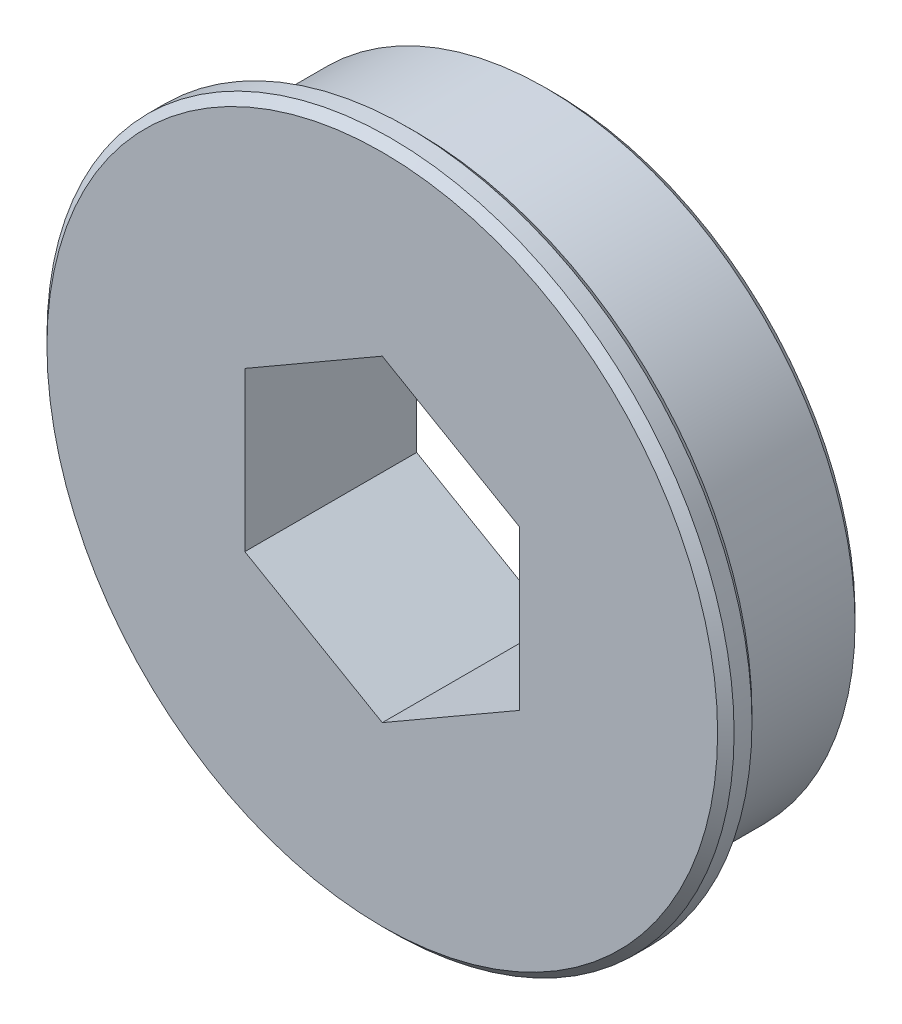
ISO-10303-21;
HEADER;
FILE_DESCRIPTION(('STEP AP214'),'2;1');
FILE_NAME('part.step','',(''),(''),'','','');
FILE_SCHEMA(('AUTOMOTIVE_DESIGN { 1 0 10303 214 1 1 1 1 }'));
ENDSEC;
DATA;
#1=APPLICATION_CONTEXT('core data for automotive mechanical design processes');
#2=APPLICATION_PROTOCOL_DEFINITION('international standard','automotive_design',2000,#1);
#3=PRODUCT_CONTEXT('',#1,'mechanical');
#4=PRODUCT('Part','Part','',(#3));
#5=PRODUCT_RELATED_PRODUCT_CATEGORY('part','',(#4));
#6=PRODUCT_DEFINITION_FORMATION('','',#4);
#7=PRODUCT_DEFINITION_CONTEXT('part definition',#1,'design');
#8=PRODUCT_DEFINITION('design','',#6,#7);
#9=PRODUCT_DEFINITION_SHAPE('','',#8);
#10=(LENGTH_UNIT() NAMED_UNIT(*) SI_UNIT(.MILLI.,.METRE.));
#11=(NAMED_UNIT(*) PLANE_ANGLE_UNIT() SI_UNIT($,.RADIAN.));
#12=(NAMED_UNIT(*) SI_UNIT($,.STERADIAN.) SOLID_ANGLE_UNIT());
#13=UNCERTAINTY_MEASURE_WITH_UNIT(LENGTH_MEASURE(1.E-05),#10,'distance_accuracy_value','');
#14=(GEOMETRIC_REPRESENTATION_CONTEXT(3) GLOBAL_UNCERTAINTY_ASSIGNED_CONTEXT((#13)) GLOBAL_UNIT_ASSIGNED_CONTEXT((#10,
#11,#12)) REPRESENTATION_CONTEXT('',''));
#15=CARTESIAN_POINT('',(0.,0.,0.));
#16=DIRECTION('',(0.,0.,1.));
#17=DIRECTION('',(1.,0.,0.));
#18=AXIS2_PLACEMENT_3D('',#15,#16,#17);
#19=CARTESIAN_POINT('',(0.,0.,6.35));
#20=DIRECTION('',(0.,0.,1.));
#21=DIRECTION('',(1.,0.,0.));
#22=AXIS2_PLACEMENT_3D('',#19,#20,#21);
#23=PLANE('',#22);
#24=CARTESIAN_POINT('',(0.,0.,6.35));
#25=DIRECTION('',(0.,0.,1.));
#26=DIRECTION('',(1.,0.,0.));
#27=AXIS2_PLACEMENT_3D('',#24,#25,#26);
#28=CIRCLE('',#27,14.2875);
#29=CARTESIAN_POINT('',(14.2875,0.,6.35));
#30=VERTEX_POINT('',#29);
#31=EDGE_CURVE('E18',#30,#30,#28,.F.);
#32=ORIENTED_EDGE('',*,*,#31,.F.);
#33=EDGE_LOOP('',(#32));
#34=FACE_BOUND('',#33,.T.);
#35=CARTESIAN_POINT('',(0.,0.,6.35000000000049));
#36=DIRECTION('',(0.,0.,1.));
#37=DIRECTION('',(0.,-1.,0.));
#38=AXIS2_PLACEMENT_3D('',#35,#36,#37);
#39=CIRCLE('',#38,15.4939999999995);
#40=CARTESIAN_POINT('',(0.,-15.4939999999995,6.35000000000049));
#41=VERTEX_POINT('',#40);
#42=EDGE_CURVE('E108',#41,#41,#39,.T.);
#43=ORIENTED_EDGE('',*,*,#42,.F.);
#44=EDGE_LOOP('',(#43));
#45=FACE_BOUND('',#44,.T.);
#46=ADVANCED_FACE('F15',(#34,#45),#23,.F.);
#47=CARTESIAN_POINT('',(0.,0.,0.));
#48=DIRECTION('',(0.,0.,1.));
#49=DIRECTION('',(1.,0.,0.));
#50=AXIS2_PLACEMENT_3D('',#47,#48,#49);
#51=CYLINDRICAL_SURFACE('',#50,14.2875);
#52=CARTESIAN_POINT('',(0.,0.,0.380999999999514));
#53=DIRECTION('',(0.,0.,1.));
#54=DIRECTION('',(-1.,0.,0.));
#55=AXIS2_PLACEMENT_3D('',#52,#53,#54);
#56=CIRCLE('',#55,14.2875000000005);
#57=CARTESIAN_POINT('',(-14.2875000000005,0.,0.380999999999513));
#58=VERTEX_POINT('',#57);
#59=EDGE_CURVE('E103',#58,#58,#56,.F.);
#60=ORIENTED_EDGE('',*,*,#59,.F.);
#61=EDGE_LOOP('',(#60));
#62=FACE_BOUND('',#61,.T.);
#63=ORIENTED_EDGE('',*,*,#31,.T.);
#64=EDGE_LOOP('',(#63));
#65=FACE_BOUND('',#64,.T.);
#66=ADVANCED_FACE('F123',(#62,#65),#51,.T.);
#67=CARTESIAN_POINT('',(0.,0.,6.73099999999951));
#68=DIRECTION('',(0.,0.,1.));
#69=DIRECTION('',(0.,-1.,0.));
#70=AXIS2_PLACEMENT_3D('',#67,#68,#69);
#71=CONICAL_SURFACE('',#70,15.8750000000005,0.785398163399999);
#72=ORIENTED_EDGE('',*,*,#42,.T.);
#73=EDGE_LOOP('',(#72));
#74=FACE_BOUND('',#73,.T.);
#75=CARTESIAN_POINT('',(0.,0.,6.731));
#76=DIRECTION('',(0.,0.,1.));
#77=DIRECTION('',(1.,0.,0.));
#78=AXIS2_PLACEMENT_3D('',#75,#76,#77);
#79=CIRCLE('',#78,15.875);
#80=CARTESIAN_POINT('',(15.875,0.,6.731));
#81=VERTEX_POINT('',#80);
#82=EDGE_CURVE('E100',#81,#81,#79,.T.);
#83=ORIENTED_EDGE('',*,*,#82,.F.);
#84=EDGE_LOOP('',(#83));
#85=FACE_BOUND('',#84,.T.);
#86=ADVANCED_FACE('F131',(#74,#85),#71,.T.);
#87=CARTESIAN_POINT('',(0.,0.,0.380999999999514));
#88=DIRECTION('',(0.,0.,1.));
#89=DIRECTION('',(0.,-1.,0.));
#90=AXIS2_PLACEMENT_3D('',#87,#88,#89);
#91=CONICAL_SURFACE('',#90,14.2875000000005,0.785398163399999);
#92=CARTESIAN_POINT('',(0.,0.,4.86644145120119E-13));
#93=DIRECTION('',(0.,0.,1.));
#94=DIRECTION('',(0.,-1.,0.));
#95=AXIS2_PLACEMENT_3D('',#92,#93,#94);
#96=CIRCLE('',#95,13.9064999999995);
#97=CARTESIAN_POINT('',(0.,-13.9064999999995,4.86617762867255E-13));
#98=VERTEX_POINT('',#97);
#99=EDGE_CURVE('E97',#98,#98,#96,.T.);
#100=ORIENTED_EDGE('',*,*,#99,.T.);
#101=EDGE_LOOP('',(#100));
#102=FACE_BOUND('',#101,.T.);
#103=ORIENTED_EDGE('',*,*,#59,.T.);
#104=EDGE_LOOP('',(#103));
#105=FACE_BOUND('',#104,.T.);
#106=ADVANCED_FACE('F170',(#102,#105),#91,.T.);
#107=CARTESIAN_POINT('',(0.,0.,6.35));
#108=DIRECTION('',(0.,0.,1.));
#109=DIRECTION('',(1.,0.,0.));
#110=AXIS2_PLACEMENT_3D('',#107,#108,#109);
#111=CYLINDRICAL_SURFACE('',#110,15.875);
#112=ORIENTED_EDGE('',*,*,#82,.T.);
#113=EDGE_LOOP('',(#112));
#114=FACE_BOUND('',#113,.T.);
#115=CARTESIAN_POINT('',(0.,0.,7.55650000000049));
#116=DIRECTION('',(0.,0.,-1.));
#117=DIRECTION('',(-1.,0.,0.));
#118=AXIS2_PLACEMENT_3D('',#115,#116,#117);
#119=CIRCLE('',#118,15.8750000000005);
#120=CARTESIAN_POINT('',(-15.8750000000005,0.,7.55650000000049));
#121=VERTEX_POINT('',#120);
#122=EDGE_CURVE('E79',#121,#121,#119,.F.);
#123=ORIENTED_EDGE('',*,*,#122,.F.);
#124=EDGE_LOOP('',(#123));
#125=FACE_BOUND('',#124,.T.);
#126=ADVANCED_FACE('F167',(#114,#125),#111,.T.);
#127=CARTESIAN_POINT('',(0.,0.,0.));
#128=DIRECTION('',(0.,0.,1.));
#129=DIRECTION('',(1.,0.,0.));
#130=AXIS2_PLACEMENT_3D('',#127,#128,#129);
#131=PLANE('',#130);
#132=DIRECTION('',(0.,-1.,0.));
#133=VECTOR('',#132,1.);
#134=CARTESIAN_POINT('',(-6.35,-3.66617420935414,0.));
#135=LINE('',#134,#133);
#136=CARTESIAN_POINT('',(-6.35,3.66617420935411,0.));
#137=VERTEX_POINT('',#136);
#138=CARTESIAN_POINT('',(-6.35,-3.66617420935414,0.));
#139=VERTEX_POINT('',#138);
#140=EDGE_CURVE('E115',#137,#139,#135,.T.);
#141=ORIENTED_EDGE('',*,*,#140,.T.);
#142=DIRECTION('',(0.866025403784439,-0.499999999999999,0.));
#143=VECTOR('',#142,1.);
#144=CARTESIAN_POINT('',(0.,-7.33234841870825,0.));
#145=LINE('',#144,#143);
#146=CARTESIAN_POINT('',(0.,-7.33234841870824,0.));
#147=VERTEX_POINT('',#146);
#148=EDGE_CURVE('E293',#139,#147,#145,.T.);
#149=ORIENTED_EDGE('',*,*,#148,.T.);
#150=DIRECTION('',(0.866025403784438,0.5,0.));
#151=VECTOR('',#150,1.);
#152=CARTESIAN_POINT('',(6.35,-3.66617420935411,0.));
#153=LINE('',#152,#151);
#154=CARTESIAN_POINT('',(6.35,-3.66617420935411,0.));
#155=VERTEX_POINT('',#154);
#156=EDGE_CURVE('E278',#147,#155,#153,.T.);
#157=ORIENTED_EDGE('',*,*,#156,.T.);
#158=DIRECTION('',(0.,1.,0.));
#159=VECTOR('',#158,1.);
#160=CARTESIAN_POINT('',(6.35,3.66617420935414,0.));
#161=LINE('',#160,#159);
#162=CARTESIAN_POINT('',(6.35,3.66617420935414,0.));
#163=VERTEX_POINT('',#162);
#164=EDGE_CURVE('E84',#155,#163,#161,.T.);
#165=ORIENTED_EDGE('',*,*,#164,.T.);
#166=DIRECTION('',(-0.866025403784439,0.499999999999999,0.));
#167=VECTOR('',#166,1.);
#168=CARTESIAN_POINT('',(0.,7.33234841870825,0.));
#169=LINE('',#168,#167);
#170=CARTESIAN_POINT('',(0.,7.33234841870825,0.));
#171=VERTEX_POINT('',#170);
#172=EDGE_CURVE('E65',#163,#171,#169,.T.);
#173=ORIENTED_EDGE('',*,*,#172,.T.);
#174=DIRECTION('',(-0.866025403784438,-0.500000000000001,0.));
#175=VECTOR('',#174,1.);
#176=CARTESIAN_POINT('',(-6.35,3.66617420935411,0.));
#177=LINE('',#176,#175);
#178=EDGE_CURVE('E70',#171,#137,#177,.T.);
#179=ORIENTED_EDGE('',*,*,#178,.T.);
#180=EDGE_LOOP('',(#141,#149,#157,#165,#173,#179));
#181=FACE_BOUND('',#180,.T.);
#182=ORIENTED_EDGE('',*,*,#99,.F.);
#183=EDGE_LOOP('',(#182));
#184=FACE_BOUND('',#183,.T.);
#185=ADVANCED_FACE('F81',(#181,#184),#131,.F.);
#186=CARTESIAN_POINT('',(0.,0.,7.55650000000049));
#187=DIRECTION('',(0.,0.,-1.));
#188=DIRECTION('',(0.,1.,0.));
#189=AXIS2_PLACEMENT_3D('',#186,#187,#188);
#190=CONICAL_SURFACE('',#189,15.8750000000005,0.7853981634);
#191=CARTESIAN_POINT('',(0.,0.,7.93749999999951));
#192=DIRECTION('',(0.,0.,-1.));
#193=DIRECTION('',(0.,1.,0.));
#194=AXIS2_PLACEMENT_3D('',#191,#192,#193);
#195=CIRCLE('',#194,15.4939999999995);
#196=CARTESIAN_POINT('',(0.,15.4939999999995,7.93749999999951));
#197=VERTEX_POINT('',#196);
#198=EDGE_CURVE('E111',#197,#197,#195,.F.);
#199=ORIENTED_EDGE('',*,*,#198,.F.);
#200=EDGE_LOOP('',(#199));
#201=FACE_BOUND('',#200,.T.);
#202=ORIENTED_EDGE('',*,*,#122,.T.);
#203=EDGE_LOOP('',(#202));
#204=FACE_BOUND('',#203,.T.);
#205=ADVANCED_FACE('F161',(#201,#204),#190,.T.);
#206=CARTESIAN_POINT('',(-6.35,3.66617420935411,7.9375));
#207=DIRECTION('',(-0.500000000000001,0.866025403784438,0.));
#208=DIRECTION('',(-0.866025403784438,-0.500000000000001,0.));
#209=AXIS2_PLACEMENT_3D('',#206,#207,#208);
#210=PLANE('',#209);
#211=DIRECTION('',(0.,0.,1.));
#212=VECTOR('',#211,1.);
#213=CARTESIAN_POINT('',(0.,7.33234841870825,7.9375));
#214=LINE('',#213,#212);
#215=CARTESIAN_POINT('',(0.,7.33234841870825,7.9375));
#216=VERTEX_POINT('',#215);
#217=EDGE_CURVE('E72',#171,#216,#214,.T.);
#218=ORIENTED_EDGE('',*,*,#217,.T.);
#219=DIRECTION('',(0.866025403784438,0.500000000000002,0.));
#220=VECTOR('',#219,1.);
#221=CARTESIAN_POINT('',(-6.35,3.66617420935411,7.9375));
#222=LINE('',#221,#220);
#223=CARTESIAN_POINT('',(-6.35,3.66617420935411,7.9375));
#224=VERTEX_POINT('',#223);
#225=EDGE_CURVE('E114',#224,#216,#222,.T.);
#226=ORIENTED_EDGE('',*,*,#225,.F.);
#227=DIRECTION('',(0.,0.,1.));
#228=VECTOR('',#227,1.);
#229=CARTESIAN_POINT('',(-6.35,3.66617420935411,7.9375));
#230=LINE('',#229,#228);
#231=EDGE_CURVE('E75',#224,#137,#230,.F.);
#232=ORIENTED_EDGE('',*,*,#231,.T.);
#233=ORIENTED_EDGE('',*,*,#178,.F.);
#234=EDGE_LOOP('',(#218,#226,#232,#233));
#235=FACE_BOUND('',#234,.T.);
#236=ADVANCED_FACE('F71',(#235),#210,.F.);
#237=CARTESIAN_POINT('',(0.,7.33234841870825,7.9375));
#238=DIRECTION('',(0.499999999999999,0.866025403784439,0.));
#239=DIRECTION('',(-0.866025403784439,0.499999999999999,0.));
#240=AXIS2_PLACEMENT_3D('',#237,#238,#239);
#241=PLANE('',#240);
#242=DIRECTION('',(0.,0.,1.));
#243=VECTOR('',#242,1.);
#244=CARTESIAN_POINT('',(6.35,3.66617420935414,7.9375));
#245=LINE('',#244,#243);
#246=CARTESIAN_POINT('',(6.35,3.66617420935414,7.9375));
#247=VERTEX_POINT('',#246);
#248=EDGE_CURVE('E86',#163,#247,#245,.T.);
#249=ORIENTED_EDGE('',*,*,#248,.T.);
#250=DIRECTION('',(0.86602540378444,-0.499999999999998,0.));
#251=VECTOR('',#250,1.);
#252=CARTESIAN_POINT('',(0.,7.33234841870825,7.9375));
#253=LINE('',#252,#251);
#254=EDGE_CURVE('E90',#216,#247,#253,.T.);
#255=ORIENTED_EDGE('',*,*,#254,.F.);
#256=ORIENTED_EDGE('',*,*,#217,.F.);
#257=ORIENTED_EDGE('',*,*,#172,.F.);
#258=EDGE_LOOP('',(#249,#255,#256,#257));
#259=FACE_BOUND('',#258,.T.);
#260=ADVANCED_FACE('F88',(#259),#241,.F.);
#261=CARTESIAN_POINT('',(6.35,3.66617420935414,7.9375));
#262=DIRECTION('',(1.,0.,0.));
#263=DIRECTION('',(0.,1.,0.));
#264=AXIS2_PLACEMENT_3D('',#261,#262,#263);
#265=PLANE('',#264);
#266=DIRECTION('',(0.,0.,1.));
#267=VECTOR('',#266,1.);
#268=CARTESIAN_POINT('',(6.35,-3.66617420935411,7.9375));
#269=LINE('',#268,#267);
#270=CARTESIAN_POINT('',(6.35,-3.66617420935411,7.9375));
#271=VERTEX_POINT('',#270);
#272=EDGE_CURVE('E274',#155,#271,#269,.T.);
#273=ORIENTED_EDGE('',*,*,#272,.T.);
#274=DIRECTION('',(0.,1.,0.));
#275=VECTOR('',#274,1.);
#276=CARTESIAN_POINT('',(6.35,0.,7.9375));
#277=LINE('',#276,#275);
#278=EDGE_CURVE('E277',#247,#271,#277,.F.);
#279=ORIENTED_EDGE('',*,*,#278,.F.);
#280=ORIENTED_EDGE('',*,*,#248,.F.);
#281=ORIENTED_EDGE('',*,*,#164,.F.);
#282=EDGE_LOOP('',(#273,#279,#280,#281));
#283=FACE_BOUND('',#282,.T.);
#284=ADVANCED_FACE('F152',(#283),#265,.F.);
#285=CARTESIAN_POINT('',(6.35,-3.66617420935411,7.9375));
#286=DIRECTION('',(0.5,-0.866025403784438,0.));
#287=DIRECTION('',(0.866025403784438,0.5,0.));
#288=AXIS2_PLACEMENT_3D('',#285,#286,#287);
#289=PLANE('',#288);
#290=DIRECTION('',(0.,0.,1.));
#291=VECTOR('',#290,1.);
#292=CARTESIAN_POINT('',(0.,-7.33234841870825,7.9375));
#293=LINE('',#292,#291);
#294=CARTESIAN_POINT('',(0.,-7.33234841870824,7.9375));
#295=VERTEX_POINT('',#294);
#296=EDGE_CURVE('E283',#147,#295,#293,.T.);
#297=ORIENTED_EDGE('',*,*,#296,.T.);
#298=DIRECTION('',(-0.866025403784438,-0.500000000000002,0.));
#299=VECTOR('',#298,1.);
#300=CARTESIAN_POINT('',(6.35,-3.66617420935411,7.9375));
#301=LINE('',#300,#299);
#302=EDGE_CURVE('E281',#271,#295,#301,.T.);
#303=ORIENTED_EDGE('',*,*,#302,.F.);
#304=ORIENTED_EDGE('',*,*,#272,.F.);
#305=ORIENTED_EDGE('',*,*,#156,.F.);
#306=EDGE_LOOP('',(#297,#303,#304,#305));
#307=FACE_BOUND('',#306,.T.);
#308=ADVANCED_FACE('F149',(#307),#289,.F.);
#309=CARTESIAN_POINT('',(0.,-7.33234841870825,7.9375));
#310=DIRECTION('',(-0.499999999999999,-0.866025403784439,0.));
#311=DIRECTION('',(0.866025403784439,-0.499999999999999,0.));
#312=AXIS2_PLACEMENT_3D('',#309,#310,#311);
#313=PLANE('',#312);
#314=DIRECTION('',(0.,0.,1.));
#315=VECTOR('',#314,1.);
#316=CARTESIAN_POINT('',(-6.35,-3.66617420935414,7.9375));
#317=LINE('',#316,#315);
#318=CARTESIAN_POINT('',(-6.35,-3.66617420935414,7.9375));
#319=VERTEX_POINT('',#318);
#320=EDGE_CURVE('E33',#139,#319,#317,.T.);
#321=ORIENTED_EDGE('',*,*,#320,.T.);
#322=DIRECTION('',(-0.866025403784439,0.499999999999999,0.));
#323=VECTOR('',#322,1.);
#324=CARTESIAN_POINT('',(0.,-7.33234841870825,7.9375));
#325=LINE('',#324,#323);
#326=EDGE_CURVE('E24',#295,#319,#325,.T.);
#327=ORIENTED_EDGE('',*,*,#326,.F.);
#328=ORIENTED_EDGE('',*,*,#296,.F.);
#329=ORIENTED_EDGE('',*,*,#148,.F.);
#330=EDGE_LOOP('',(#321,#327,#328,#329));
#331=FACE_BOUND('',#330,.T.);
#332=ADVANCED_FACE('F141',(#331),#313,.F.);
#333=CARTESIAN_POINT('',(-6.35,-3.66617420935414,7.9375));
#334=DIRECTION('',(-1.,0.,0.));
#335=DIRECTION('',(0.,-1.,0.));
#336=AXIS2_PLACEMENT_3D('',#333,#334,#335);
#337=PLANE('',#336);
#338=ORIENTED_EDGE('',*,*,#231,.F.);
#339=DIRECTION('',(0.,1.,0.));
#340=VECTOR('',#339,1.);
#341=CARTESIAN_POINT('',(-6.35,0.,7.9375));
#342=LINE('',#341,#340);
#343=EDGE_CURVE('E9',#319,#224,#342,.T.);
#344=ORIENTED_EDGE('',*,*,#343,.F.);
#345=ORIENTED_EDGE('',*,*,#320,.F.);
#346=ORIENTED_EDGE('',*,*,#140,.F.);
#347=EDGE_LOOP('',(#338,#344,#345,#346));
#348=FACE_BOUND('',#347,.T.);
#349=ADVANCED_FACE('F135',(#348),#337,.F.);
#350=CARTESIAN_POINT('',(0.,0.,7.9375));
#351=DIRECTION('',(0.,0.,1.));
#352=DIRECTION('',(1.,0.,0.));
#353=AXIS2_PLACEMENT_3D('',#350,#351,#352);
#354=PLANE('',#353);
#355=ORIENTED_EDGE('',*,*,#326,.T.);
#356=ORIENTED_EDGE('',*,*,#343,.T.);
#357=ORIENTED_EDGE('',*,*,#225,.T.);
#358=ORIENTED_EDGE('',*,*,#254,.T.);
#359=ORIENTED_EDGE('',*,*,#278,.T.);
#360=ORIENTED_EDGE('',*,*,#302,.T.);
#361=EDGE_LOOP('',(#355,#356,#357,#358,#359,#360));
#362=FACE_BOUND('',#361,.T.);
#363=ORIENTED_EDGE('',*,*,#198,.T.);
#364=EDGE_LOOP('',(#363));
#365=FACE_BOUND('',#364,.T.);
#366=ADVANCED_FACE('F133',(#362,#365),#354,.T.);
#367=CLOSED_SHELL('',(#46,#66,#86,#106,#126,#185,#205,#236,#260,#284,#308,#332,#349,#366));
#368=MANIFOLD_SOLID_BREP('B1',#367);
#369=ADVANCED_BREP_SHAPE_REPRESENTATION('',(#18,#368),#14);
#370=SHAPE_DEFINITION_REPRESENTATION(#9,#369);
ENDSEC;
END-ISO-10303-21;
